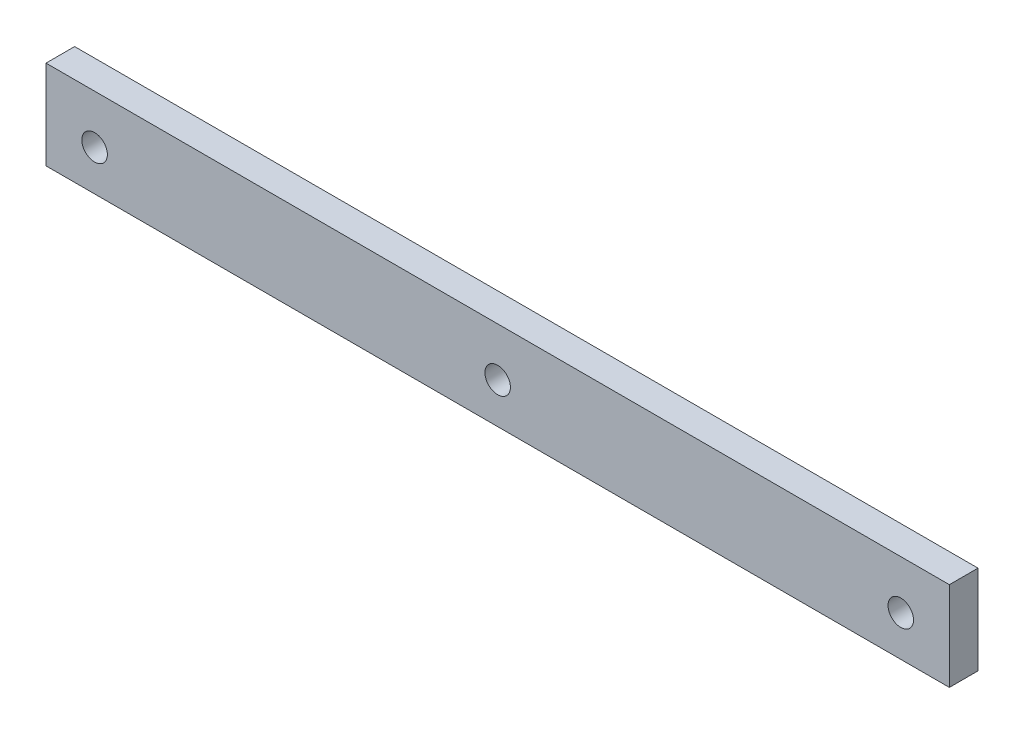
ISO-10303-21;
HEADER;
FILE_DESCRIPTION(('STEP AP214'),'2;1');
FILE_NAME('part.step','',(''),(''),'','','');
FILE_SCHEMA(('AUTOMOTIVE_DESIGN { 1 0 10303 214 1 1 1 1 }'));
ENDSEC;
DATA;
#1=APPLICATION_CONTEXT('core data for automotive mechanical design processes');
#2=APPLICATION_PROTOCOL_DEFINITION('international standard','automotive_design',2000,#1);
#3=PRODUCT_CONTEXT('',#1,'mechanical');
#4=PRODUCT('Part','Part','',(#3));
#5=PRODUCT_RELATED_PRODUCT_CATEGORY('part','',(#4));
#6=PRODUCT_DEFINITION_FORMATION('','',#4);
#7=PRODUCT_DEFINITION_CONTEXT('part definition',#1,'design');
#8=PRODUCT_DEFINITION('design','',#6,#7);
#9=PRODUCT_DEFINITION_SHAPE('','',#8);
#10=(LENGTH_UNIT() NAMED_UNIT(*) SI_UNIT(.MILLI.,.METRE.));
#11=(NAMED_UNIT(*) PLANE_ANGLE_UNIT() SI_UNIT($,.RADIAN.));
#12=(NAMED_UNIT(*) SI_UNIT($,.STERADIAN.) SOLID_ANGLE_UNIT());
#13=UNCERTAINTY_MEASURE_WITH_UNIT(LENGTH_MEASURE(1.E-05),#10,'distance_accuracy_value','');
#14=(GEOMETRIC_REPRESENTATION_CONTEXT(3) GLOBAL_UNCERTAINTY_ASSIGNED_CONTEXT((#13)) GLOBAL_UNIT_ASSIGNED_CONTEXT((#10,
#11,#12)) REPRESENTATION_CONTEXT('',''));
#15=CARTESIAN_POINT('',(0.,0.,0.));
#16=DIRECTION('',(0.,0.,1.));
#17=DIRECTION('',(1.,0.,0.));
#18=AXIS2_PLACEMENT_3D('',#15,#16,#17);
#19=CARTESIAN_POINT('',(50.085,4.935,3.175));
#20=DIRECTION('',(-1.,0.,0.));
#21=DIRECTION('',(0.,0.,1.));
#22=AXIS2_PLACEMENT_3D('',#19,#20,#21);
#23=PLANE('',#22);
#24=DIRECTION('',(0.,1.,0.));
#25=VECTOR('',#24,1.);
#26=CARTESIAN_POINT('',(50.085,4.935,0.));
#27=LINE('',#26,#25);
#28=CARTESIAN_POINT('',(50.085,-4.935,0.));
#29=VERTEX_POINT('',#28);
#30=CARTESIAN_POINT('',(50.085,4.935,0.));
#31=VERTEX_POINT('',#30);
#32=EDGE_CURVE('E99',#29,#31,#27,.T.);
#33=ORIENTED_EDGE('',*,*,#32,.T.);
#34=DIRECTION('',(0.,0.,-1.));
#35=VECTOR('',#34,1.);
#36=CARTESIAN_POINT('',(50.085,4.935,3.175));
#37=LINE('',#36,#35);
#38=CARTESIAN_POINT('',(50.085,4.935,3.175));
#39=VERTEX_POINT('',#38);
#40=EDGE_CURVE('E11',#39,#31,#37,.T.);
#41=ORIENTED_EDGE('',*,*,#40,.F.);
#42=DIRECTION('',(0.,1.,0.));
#43=VECTOR('',#42,1.);
#44=CARTESIAN_POINT('',(50.085,4.935,3.175));
#45=LINE('',#44,#43);
#46=CARTESIAN_POINT('',(50.085,-4.935,3.175));
#47=VERTEX_POINT('',#46);
#48=EDGE_CURVE('E87',#47,#39,#45,.T.);
#49=ORIENTED_EDGE('',*,*,#48,.F.);
#50=DIRECTION('',(0.,0.,-1.));
#51=VECTOR('',#50,1.);
#52=CARTESIAN_POINT('',(50.085,-4.935,3.175));
#53=LINE('',#52,#51);
#54=EDGE_CURVE('E95',#47,#29,#53,.T.);
#55=ORIENTED_EDGE('',*,*,#54,.T.);
#56=EDGE_LOOP('',(#33,#41,#49,#55));
#57=FACE_BOUND('',#56,.T.);
#58=ADVANCED_FACE('F36',(#57),#23,.F.);
#59=CARTESIAN_POINT('',(-50.085,4.935,3.175));
#60=DIRECTION('',(0.,-1.,0.));
#61=DIRECTION('',(0.,0.,-1.));
#62=AXIS2_PLACEMENT_3D('',#59,#60,#61);
#63=PLANE('',#62);
#64=DIRECTION('',(-1.,0.,0.));
#65=VECTOR('',#64,1.);
#66=CARTESIAN_POINT('',(-50.085,4.935,0.));
#67=LINE('',#66,#65);
#68=CARTESIAN_POINT('',(-50.085,4.935,0.));
#69=VERTEX_POINT('',#68);
#70=EDGE_CURVE('E91',#31,#69,#67,.T.);
#71=ORIENTED_EDGE('',*,*,#70,.T.);
#72=DIRECTION('',(0.,0.,-1.));
#73=VECTOR('',#72,1.);
#74=CARTESIAN_POINT('',(-50.085,4.935,3.175));
#75=LINE('',#74,#73);
#76=CARTESIAN_POINT('',(-50.085,4.935,3.175));
#77=VERTEX_POINT('',#76);
#78=EDGE_CURVE('E44',#77,#69,#75,.T.);
#79=ORIENTED_EDGE('',*,*,#78,.F.);
#80=DIRECTION('',(-1.,0.,0.));
#81=VECTOR('',#80,1.);
#82=CARTESIAN_POINT('',(-50.085,4.935,3.175));
#83=LINE('',#82,#81);
#84=EDGE_CURVE('E82',#39,#77,#83,.T.);
#85=ORIENTED_EDGE('',*,*,#84,.F.);
#86=ORIENTED_EDGE('',*,*,#40,.T.);
#87=EDGE_LOOP('',(#71,#79,#85,#86));
#88=FACE_BOUND('',#87,.T.);
#89=ADVANCED_FACE('F90',(#88),#63,.F.);
#90=CARTESIAN_POINT('',(-50.085,4.935,3.175));
#91=DIRECTION('',(1.,0.,0.));
#92=DIRECTION('',(0.,0.,-1.));
#93=AXIS2_PLACEMENT_3D('',#90,#91,#92);
#94=PLANE('',#93);
#95=DIRECTION('',(0.,-1.,0.));
#96=VECTOR('',#95,1.);
#97=CARTESIAN_POINT('',(-50.085,4.935,0.));
#98=LINE('',#97,#96);
#99=CARTESIAN_POINT('',(-50.085,-4.935,0.));
#100=VERTEX_POINT('',#99);
#101=EDGE_CURVE('E69',#69,#100,#98,.T.);
#102=ORIENTED_EDGE('',*,*,#101,.T.);
#103=DIRECTION('',(0.,0.,-1.));
#104=VECTOR('',#103,1.);
#105=CARTESIAN_POINT('',(-50.085,-4.935,3.175));
#106=LINE('',#105,#104);
#107=CARTESIAN_POINT('',(-50.085,-4.935,3.175));
#108=VERTEX_POINT('',#107);
#109=EDGE_CURVE('E92',#108,#100,#106,.T.);
#110=ORIENTED_EDGE('',*,*,#109,.F.);
#111=DIRECTION('',(0.,-1.,0.));
#112=VECTOR('',#111,1.);
#113=CARTESIAN_POINT('',(-50.085,4.935,3.175));
#114=LINE('',#113,#112);
#115=EDGE_CURVE('E85',#77,#108,#114,.T.);
#116=ORIENTED_EDGE('',*,*,#115,.F.);
#117=ORIENTED_EDGE('',*,*,#78,.T.);
#118=EDGE_LOOP('',(#102,#110,#116,#117));
#119=FACE_BOUND('',#118,.T.);
#120=ADVANCED_FACE('F93',(#119),#94,.F.);
#121=CARTESIAN_POINT('',(-50.085,-4.935,3.175));
#122=DIRECTION('',(0.,1.,0.));
#123=DIRECTION('',(0.,0.,1.));
#124=AXIS2_PLACEMENT_3D('',#121,#122,#123);
#125=PLANE('',#124);
#126=DIRECTION('',(1.,0.,0.));
#127=VECTOR('',#126,1.);
#128=CARTESIAN_POINT('',(-50.085,-4.935,0.));
#129=LINE('',#128,#127);
#130=EDGE_CURVE('E75',#100,#29,#129,.T.);
#131=ORIENTED_EDGE('',*,*,#130,.T.);
#132=ORIENTED_EDGE('',*,*,#54,.F.);
#133=DIRECTION('',(1.,0.,0.));
#134=VECTOR('',#133,1.);
#135=CARTESIAN_POINT('',(-50.085,-4.935,3.175));
#136=LINE('',#135,#134);
#137=EDGE_CURVE('E52',#108,#47,#136,.T.);
#138=ORIENTED_EDGE('',*,*,#137,.F.);
#139=ORIENTED_EDGE('',*,*,#109,.T.);
#140=EDGE_LOOP('',(#131,#132,#138,#139));
#141=FACE_BOUND('',#140,.T.);
#142=ADVANCED_FACE('F107',(#141),#125,.F.);
#143=CARTESIAN_POINT('',(0.,0.,3.175));
#144=DIRECTION('',(0.,0.,1.));
#145=DIRECTION('',(1.,0.,0.));
#146=AXIS2_PLACEMENT_3D('',#143,#144,#145);
#147=PLANE('',#146);
#148=CARTESIAN_POINT('',(0.,-0.453300858899081,3.175));
#149=DIRECTION('',(0.,0.,1.));
#150=DIRECTION('',(1.,0.,0.));
#151=AXIS2_PLACEMENT_3D('',#148,#149,#150);
#152=CIRCLE('',#151,1.415);
#153=CARTESIAN_POINT('',(1.415,-0.453300858899081,3.175));
#154=VERTEX_POINT('',#153);
#155=EDGE_CURVE('E125',#154,#154,#152,.T.);
#156=ORIENTED_EDGE('',*,*,#155,.F.);
#157=EDGE_LOOP('',(#156));
#158=FACE_BOUND('',#157,.T.);
#159=CARTESIAN_POINT('',(-44.6966991411009,-0.453300858899081,3.175));
#160=DIRECTION('',(0.,0.,1.));
#161=DIRECTION('',(1.,0.,0.));
#162=AXIS2_PLACEMENT_3D('',#159,#160,#161);
#163=CIRCLE('',#162,1.415);
#164=CARTESIAN_POINT('',(-43.2816991411009,-0.453300858899081,3.175));
#165=VERTEX_POINT('',#164);
#166=EDGE_CURVE('E120',#165,#165,#163,.T.);
#167=ORIENTED_EDGE('',*,*,#166,.F.);
#168=EDGE_LOOP('',(#167));
#169=FACE_BOUND('',#168,.T.);
#170=CARTESIAN_POINT('',(44.6966991411009,-0.45330085889907,3.175));
#171=DIRECTION('',(0.,0.,1.));
#172=DIRECTION('',(-1.,0.,0.));
#173=AXIS2_PLACEMENT_3D('',#170,#171,#172);
#174=CIRCLE('',#173,1.415);
#175=CARTESIAN_POINT('',(43.2816991411009,-0.45330085889907,3.175));
#176=VERTEX_POINT('',#175);
#177=EDGE_CURVE('E113',#176,#176,#174,.T.);
#178=ORIENTED_EDGE('',*,*,#177,.F.);
#179=EDGE_LOOP('',(#178));
#180=FACE_BOUND('',#179,.T.);
#181=ORIENTED_EDGE('',*,*,#48,.T.);
#182=ORIENTED_EDGE('',*,*,#84,.T.);
#183=ORIENTED_EDGE('',*,*,#115,.T.);
#184=ORIENTED_EDGE('',*,*,#137,.T.);
#185=EDGE_LOOP('',(#181,#182,#183,#184));
#186=FACE_BOUND('',#185,.T.);
#187=ADVANCED_FACE('F83',(#158,#169,#180,#186),#147,.T.);
#188=CARTESIAN_POINT('',(0.,0.,0.));
#189=DIRECTION('',(0.,0.,1.));
#190=DIRECTION('',(1.,0.,0.));
#191=AXIS2_PLACEMENT_3D('',#188,#189,#190);
#192=PLANE('',#191);
#193=CARTESIAN_POINT('',(0.,-0.453300858899081,0.));
#194=DIRECTION('',(0.,0.,1.));
#195=DIRECTION('',(1.,0.,0.));
#196=AXIS2_PLACEMENT_3D('',#193,#194,#195);
#197=CIRCLE('',#196,1.415);
#198=CARTESIAN_POINT('',(1.415,-0.453300858899081,0.));
#199=VERTEX_POINT('',#198);
#200=EDGE_CURVE('E117',#199,#199,#197,.T.);
#201=ORIENTED_EDGE('',*,*,#200,.T.);
#202=EDGE_LOOP('',(#201));
#203=FACE_BOUND('',#202,.T.);
#204=CARTESIAN_POINT('',(-44.6966991411009,-0.453300858899081,0.));
#205=DIRECTION('',(0.,0.,1.));
#206=DIRECTION('',(1.,0.,0.));
#207=AXIS2_PLACEMENT_3D('',#204,#205,#206);
#208=CIRCLE('',#207,1.415);
#209=CARTESIAN_POINT('',(-43.2816991411009,-0.453300858899081,0.));
#210=VERTEX_POINT('',#209);
#211=EDGE_CURVE('E102',#210,#210,#208,.T.);
#212=ORIENTED_EDGE('',*,*,#211,.T.);
#213=EDGE_LOOP('',(#212));
#214=FACE_BOUND('',#213,.T.);
#215=CARTESIAN_POINT('',(44.6966991411009,-0.45330085889907,0.));
#216=DIRECTION('',(0.,0.,1.));
#217=DIRECTION('',(-1.,0.,0.));
#218=AXIS2_PLACEMENT_3D('',#215,#216,#217);
#219=CIRCLE('',#218,1.415);
#220=CARTESIAN_POINT('',(43.2816991411009,-0.45330085889907,0.));
#221=VERTEX_POINT('',#220);
#222=EDGE_CURVE('E116',#221,#221,#219,.T.);
#223=ORIENTED_EDGE('',*,*,#222,.T.);
#224=EDGE_LOOP('',(#223));
#225=FACE_BOUND('',#224,.T.);
#226=ORIENTED_EDGE('',*,*,#32,.F.);
#227=ORIENTED_EDGE('',*,*,#130,.F.);
#228=ORIENTED_EDGE('',*,*,#101,.F.);
#229=ORIENTED_EDGE('',*,*,#70,.F.);
#230=EDGE_LOOP('',(#226,#227,#228,#229));
#231=FACE_BOUND('',#230,.T.);
#232=ADVANCED_FACE('F110',(#203,#214,#225,#231),#192,.F.);
#233=CARTESIAN_POINT('',(44.6966991411009,-0.45330085889907,0.));
#234=DIRECTION('',(0.,0.,1.));
#235=DIRECTION('',(1.,0.,0.));
#236=AXIS2_PLACEMENT_3D('',#233,#234,#235);
#237=CYLINDRICAL_SURFACE('',#236,1.415);
#238=ORIENTED_EDGE('',*,*,#222,.F.);
#239=EDGE_LOOP('',(#238));
#240=FACE_BOUND('',#239,.T.);
#241=ORIENTED_EDGE('',*,*,#177,.T.);
#242=EDGE_LOOP('',(#241));
#243=FACE_BOUND('',#242,.T.);
#244=ADVANCED_FACE('F147',(#240,#243),#237,.F.);
#245=CARTESIAN_POINT('',(-44.6966991411009,-0.453300858899081,0.));
#246=DIRECTION('',(0.,0.,1.));
#247=DIRECTION('',(1.,0.,0.));
#248=AXIS2_PLACEMENT_3D('',#245,#246,#247);
#249=CYLINDRICAL_SURFACE('',#248,1.415);
#250=ORIENTED_EDGE('',*,*,#211,.F.);
#251=EDGE_LOOP('',(#250));
#252=FACE_BOUND('',#251,.T.);
#253=ORIENTED_EDGE('',*,*,#166,.T.);
#254=EDGE_LOOP('',(#253));
#255=FACE_BOUND('',#254,.T.);
#256=ADVANCED_FACE('F136',(#252,#255),#249,.F.);
#257=CARTESIAN_POINT('',(0.,-0.453300858899081,0.));
#258=DIRECTION('',(0.,0.,1.));
#259=DIRECTION('',(1.,0.,0.));
#260=AXIS2_PLACEMENT_3D('',#257,#258,#259);
#261=CYLINDRICAL_SURFACE('',#260,1.415);
#262=ORIENTED_EDGE('',*,*,#200,.F.);
#263=EDGE_LOOP('',(#262));
#264=FACE_BOUND('',#263,.T.);
#265=ORIENTED_EDGE('',*,*,#155,.T.);
#266=EDGE_LOOP('',(#265));
#267=FACE_BOUND('',#266,.T.);
#268=ADVANCED_FACE('F133',(#264,#267),#261,.F.);
#269=CLOSED_SHELL('',(#58,#89,#120,#142,#187,#232,#244,#256,#268));
#270=MANIFOLD_SOLID_BREP('B2',#269);
#271=ADVANCED_BREP_SHAPE_REPRESENTATION('',(#18,#270),#14);
#272=SHAPE_DEFINITION_REPRESENTATION(#9,#271);
ENDSEC;
END-ISO-10303-21;
